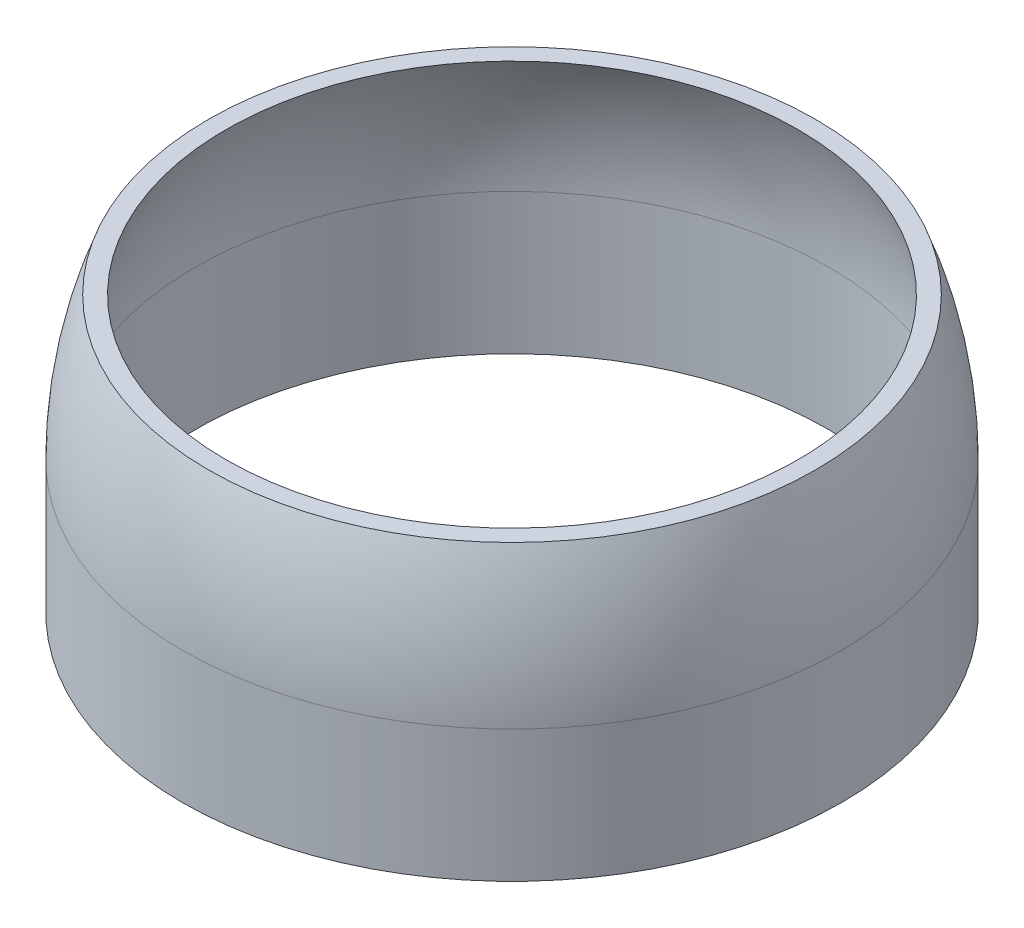
ISO-10303-21;
HEADER;
FILE_DESCRIPTION(('STEP AP214'),'2;1');
FILE_NAME('part.step','',(''),(''),'','','');
FILE_SCHEMA(('AUTOMOTIVE_DESIGN { 1 0 10303 214 1 1 1 1 }'));
ENDSEC;
DATA;
#1=APPLICATION_CONTEXT('core data for automotive mechanical design processes');
#2=APPLICATION_PROTOCOL_DEFINITION('international standard','automotive_design',2000,#1);
#3=PRODUCT_CONTEXT('',#1,'mechanical');
#4=PRODUCT('Part','Part','',(#3));
#5=PRODUCT_RELATED_PRODUCT_CATEGORY('part','',(#4));
#6=PRODUCT_DEFINITION_FORMATION('','',#4);
#7=PRODUCT_DEFINITION_CONTEXT('part definition',#1,'design');
#8=PRODUCT_DEFINITION('design','',#6,#7);
#9=PRODUCT_DEFINITION_SHAPE('','',#8);
#10=(LENGTH_UNIT() NAMED_UNIT(*) SI_UNIT(.MILLI.,.METRE.));
#11=(NAMED_UNIT(*) PLANE_ANGLE_UNIT() SI_UNIT($,.RADIAN.));
#12=(NAMED_UNIT(*) SI_UNIT($,.STERADIAN.) SOLID_ANGLE_UNIT());
#13=UNCERTAINTY_MEASURE_WITH_UNIT(LENGTH_MEASURE(1.E-05),#10,'distance_accuracy_value','');
#14=(GEOMETRIC_REPRESENTATION_CONTEXT(3) GLOBAL_UNCERTAINTY_ASSIGNED_CONTEXT((#13)) GLOBAL_UNIT_ASSIGNED_CONTEXT((#10,
#11,#12)) REPRESENTATION_CONTEXT('',''));
#15=CARTESIAN_POINT('',(0.,0.,0.));
#16=DIRECTION('',(0.,0.,1.));
#17=DIRECTION('',(1.,0.,0.));
#18=AXIS2_PLACEMENT_3D('',#15,#16,#17);
#19=CARTESIAN_POINT('',(0.,0.,0.));
#20=DIRECTION('',(0.,-1.,0.));
#21=DIRECTION('',(0.,0.,-1.));
#22=AXIS2_PLACEMENT_3D('',#19,#20,#21);
#23=CYLINDRICAL_SURFACE('',#22,37.5);
#24=CARTESIAN_POINT('',(0.,-30.5,0.));
#25=DIRECTION('',(0.,-1.,0.));
#26=DIRECTION('',(0.,0.,-1.));
#27=AXIS2_PLACEMENT_3D('',#24,#25,#26);
#28=CIRCLE('',#27,37.5);
#29=CARTESIAN_POINT('',(0.,-30.5,-37.5));
#30=VERTEX_POINT('',#29);
#31=EDGE_CURVE('E10',#30,#30,#28,.T.);
#32=ORIENTED_EDGE('',*,*,#31,.F.);
#33=EDGE_LOOP('',(#32));
#34=FACE_BOUND('',#33,.T.);
#35=CARTESIAN_POINT('',(0.,-15.5,0.));
#36=DIRECTION('',(0.,-1.,0.));
#37=DIRECTION('',(0.,0.,-1.));
#38=AXIS2_PLACEMENT_3D('',#35,#36,#37);
#39=CIRCLE('',#38,37.5);
#40=CARTESIAN_POINT('',(0.,-15.5,-37.5));
#41=VERTEX_POINT('',#40);
#42=EDGE_CURVE('E52',#41,#41,#39,.T.);
#43=ORIENTED_EDGE('',*,*,#42,.T.);
#44=EDGE_LOOP('',(#43));
#45=FACE_BOUND('',#44,.T.);
#46=ADVANCED_FACE('F30',(#34,#45),#23,.T.);
#47=CARTESIAN_POINT('',(-36.,-30.5,0.));
#48=DIRECTION('',(0.,1.,0.));
#49=DIRECTION('',(0.,0.,1.));
#50=AXIS2_PLACEMENT_3D('',#47,#48,#49);
#51=PLANE('',#50);
#52=CARTESIAN_POINT('',(0.,-30.5,0.));
#53=DIRECTION('',(0.,-1.,0.));
#54=DIRECTION('',(0.,0.,-1.));
#55=AXIS2_PLACEMENT_3D('',#52,#53,#54);
#56=CIRCLE('',#55,36.);
#57=CARTESIAN_POINT('',(0.,-30.5,-36.));
#58=VERTEX_POINT('',#57);
#59=EDGE_CURVE('E36',#58,#58,#56,.T.);
#60=ORIENTED_EDGE('',*,*,#59,.F.);
#61=EDGE_LOOP('',(#60));
#62=FACE_BOUND('',#61,.T.);
#63=ORIENTED_EDGE('',*,*,#31,.T.);
#64=EDGE_LOOP('',(#63));
#65=FACE_BOUND('',#64,.T.);
#66=ADVANCED_FACE('F77',(#62,#65),#51,.F.);
#67=CARTESIAN_POINT('',(0.,0.,0.));
#68=DIRECTION('',(0.,-1.,0.));
#69=DIRECTION('',(0.,0.,-1.));
#70=AXIS2_PLACEMENT_3D('',#67,#68,#69);
#71=CYLINDRICAL_SURFACE('',#70,36.);
#72=CARTESIAN_POINT('',(0.,-14.5,0.));
#73=DIRECTION('',(0.,-1.,0.));
#74=DIRECTION('',(0.,0.,-1.));
#75=AXIS2_PLACEMENT_3D('',#72,#73,#74);
#76=CIRCLE('',#75,36.);
#77=CARTESIAN_POINT('',(0.,-14.5,-36.));
#78=VERTEX_POINT('',#77);
#79=EDGE_CURVE('E40',#78,#78,#76,.T.);
#80=ORIENTED_EDGE('',*,*,#79,.F.);
#81=EDGE_LOOP('',(#80));
#82=FACE_BOUND('',#81,.T.);
#83=ORIENTED_EDGE('',*,*,#59,.T.);
#84=EDGE_LOOP('',(#83));
#85=FACE_BOUND('',#84,.T.);
#86=ADVANCED_FACE('F72',(#82,#85),#71,.F.);
#87=CARTESIAN_POINT('',(0.,-14.5,0.));
#88=DIRECTION('',(0.,-1.,0.));
#89=DIRECTION('',(0.,0.,-1.));
#90=AXIS2_PLACEMENT_3D('',#87,#88,#89);
#91=DEGENERATE_TOROIDAL_SURFACE('',#90,0.615022573053993,35.384977426946,.T.);
#92=CARTESIAN_POINT('',(0.,0.782477602318043,0.));
#93=DIRECTION('',(0.,-1.,0.));
#94=DIRECTION('',(0.,0.,-1.));
#95=AXIS2_PLACEMENT_3D('',#92,#93,#94);
#96=CIRCLE('',#95,32.5296353051572);
#97=CARTESIAN_POINT('',(0.,0.782477602318043,-32.5296353051572));
#98=VERTEX_POINT('',#97);
#99=EDGE_CURVE('E44',#98,#98,#96,.T.);
#100=ORIENTED_EDGE('',*,*,#99,.F.);
#101=EDGE_LOOP('',(#100));
#102=FACE_BOUND('',#101,.T.);
#103=ORIENTED_EDGE('',*,*,#79,.T.);
#104=EDGE_LOOP('',(#103));
#105=FACE_BOUND('',#104,.T.);
#106=ADVANCED_FACE('F66',(#102,#105),#91,.F.);
#107=CARTESIAN_POINT('',(-32.5296353051572,0.782477602318043,0.));
#108=DIRECTION('',(0.,-1.,0.));
#109=DIRECTION('',(0.,0.,-1.));
#110=AXIS2_PLACEMENT_3D('',#107,#108,#109);
#111=PLANE('',#110);
#112=CARTESIAN_POINT('',(0.,0.782477602318043,0.));
#113=DIRECTION('',(0.,-1.,0.));
#114=DIRECTION('',(0.,0.,-1.));
#115=AXIS2_PLACEMENT_3D('',#112,#113,#114);
#116=CIRCLE('',#115,34.5296353051572);
#117=CARTESIAN_POINT('',(0.,0.782477602318043,-34.5296353051572));
#118=VERTEX_POINT('',#117);
#119=EDGE_CURVE('E49',#118,#118,#116,.T.);
#120=ORIENTED_EDGE('',*,*,#119,.F.);
#121=EDGE_LOOP('',(#120));
#122=FACE_BOUND('',#121,.T.);
#123=ORIENTED_EDGE('',*,*,#99,.T.);
#124=EDGE_LOOP('',(#123));
#125=FACE_BOUND('',#124,.T.);
#126=ADVANCED_FACE('F60',(#122,#125),#111,.F.);
#127=CARTESIAN_POINT('',(0.,-15.5,0.));
#128=DIRECTION('',(0.,-1.,0.));
#129=DIRECTION('',(0.,0.,-1.));
#130=AXIS2_PLACEMENT_3D('',#127,#128,#129);
#131=DEGENERATE_TOROIDAL_SURFACE('',#130,8.61254364926683,46.1125436492668,.F.);
#132=ORIENTED_EDGE('',*,*,#42,.F.);
#133=EDGE_LOOP('',(#132));
#134=FACE_BOUND('',#133,.T.);
#135=ORIENTED_EDGE('',*,*,#119,.T.);
#136=EDGE_LOOP('',(#135));
#137=FACE_BOUND('',#136,.T.);
#138=ADVANCED_FACE('F57',(#134,#137),#131,.F.);
#139=CLOSED_SHELL('',(#46,#66,#86,#106,#126,#138));
#140=MANIFOLD_SOLID_BREP('B2',#139);
#141=ADVANCED_BREP_SHAPE_REPRESENTATION('',(#18,#140),#14);
#142=SHAPE_DEFINITION_REPRESENTATION(#9,#141);
ENDSEC;
END-ISO-10303-21;
